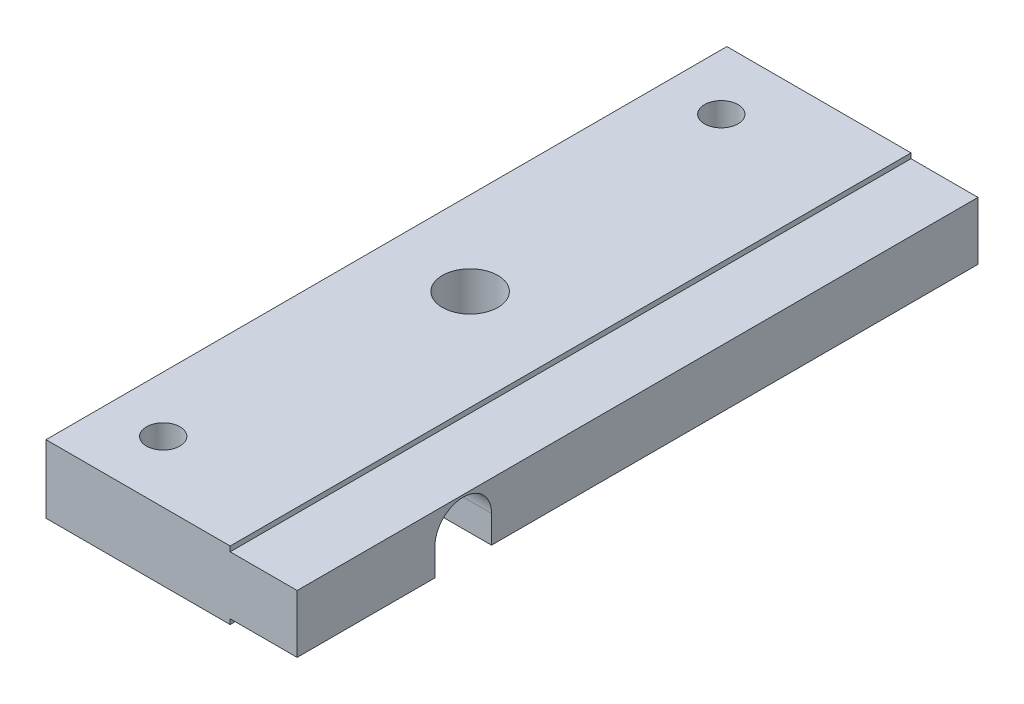
ISO-10303-21;
HEADER;
FILE_DESCRIPTION(('STEP AP214'),'2;1');
FILE_NAME('part.step','',(''),(''),'','','');
FILE_SCHEMA(('AUTOMOTIVE_DESIGN { 1 0 10303 214 1 1 1 1 }'));
ENDSEC;
DATA;
#1=APPLICATION_CONTEXT('core data for automotive mechanical design processes');
#2=APPLICATION_PROTOCOL_DEFINITION('international standard','automotive_design',2000,#1);
#3=PRODUCT_CONTEXT('',#1,'mechanical');
#4=PRODUCT('Part','Part','',(#3));
#5=PRODUCT_RELATED_PRODUCT_CATEGORY('part','',(#4));
#6=PRODUCT_DEFINITION_FORMATION('','',#4);
#7=PRODUCT_DEFINITION_CONTEXT('part definition',#1,'design');
#8=PRODUCT_DEFINITION('design','',#6,#7);
#9=PRODUCT_DEFINITION_SHAPE('','',#8);
#10=(LENGTH_UNIT() NAMED_UNIT(*) SI_UNIT(.MILLI.,.METRE.));
#11=(NAMED_UNIT(*) PLANE_ANGLE_UNIT() SI_UNIT($,.RADIAN.));
#12=(NAMED_UNIT(*) SI_UNIT($,.STERADIAN.) SOLID_ANGLE_UNIT());
#13=UNCERTAINTY_MEASURE_WITH_UNIT(LENGTH_MEASURE(1.E-05),#10,'distance_accuracy_value','');
#14=(GEOMETRIC_REPRESENTATION_CONTEXT(3) GLOBAL_UNCERTAINTY_ASSIGNED_CONTEXT((#13)) GLOBAL_UNIT_ASSIGNED_CONTEXT((#10,
#11,#12)) REPRESENTATION_CONTEXT('',''));
#15=CARTESIAN_POINT('',(0.,0.,0.));
#16=DIRECTION('',(0.,0.,1.));
#17=DIRECTION('',(1.,0.,0.));
#18=AXIS2_PLACEMENT_3D('',#15,#16,#17);
#19=CARTESIAN_POINT('',(22.5,-3.05,0.));
#20=DIRECTION('',(0.,1.,0.));
#21=DIRECTION('',(0.,0.,1.));
#22=AXIS2_PLACEMENT_3D('',#19,#20,#21);
#23=PLANE('',#22);
#24=CARTESIAN_POINT('',(5.00000000000001,-3.05,-5.5));
#25=DIRECTION('',(0.,1.,0.));
#26=DIRECTION('',(0.,0.,1.));
#27=AXIS2_PLACEMENT_3D('',#24,#25,#26);
#28=CIRCLE('',#27,1.5);
#29=CARTESIAN_POINT('',(5.00000000000001,-3.05,-4.));
#30=VERTEX_POINT('',#29);
#31=EDGE_CURVE('E302',#30,#30,#28,.T.);
#32=ORIENTED_EDGE('',*,*,#31,.T.);
#33=EDGE_LOOP('',(#32));
#34=FACE_BOUND('',#33,.T.);
#35=DIRECTION('',(0.,0.,-1.));
#36=VECTOR('',#35,1.);
#37=CARTESIAN_POINT('',(0.,-3.05,0.));
#38=LINE('',#37,#36);
#39=CARTESIAN_POINT('',(0.,-3.05,0.));
#40=VERTEX_POINT('',#39);
#41=CARTESIAN_POINT('',(0.,-3.05,-12.3486));
#42=VERTEX_POINT('',#41);
#43=EDGE_CURVE('E220',#40,#42,#38,.T.);
#44=ORIENTED_EDGE('',*,*,#43,.T.);
#45=DIRECTION('',(-1.,0.,0.));
#46=VECTOR('',#45,1.);
#47=CARTESIAN_POINT('',(22.5,-3.05,-12.3486));
#48=LINE('',#47,#46);
#49=CARTESIAN_POINT('',(16.5,-3.05,-12.3486));
#50=VERTEX_POINT('',#49);
#51=EDGE_CURVE('E171',#50,#42,#48,.T.);
#52=ORIENTED_EDGE('',*,*,#51,.F.);
#53=DIRECTION('',(0.,0.,-1.));
#54=VECTOR('',#53,1.);
#55=CARTESIAN_POINT('',(16.5,-3.05,0.));
#56=LINE('',#55,#54);
#57=CARTESIAN_POINT('',(16.5,-3.05,0.));
#58=VERTEX_POINT('',#57);
#59=EDGE_CURVE('E205',#58,#50,#56,.T.);
#60=ORIENTED_EDGE('',*,*,#59,.F.);
#61=DIRECTION('',(-1.,0.,0.));
#62=VECTOR('',#61,1.);
#63=CARTESIAN_POINT('',(22.5,-3.05,0.));
#64=LINE('',#63,#62);
#65=EDGE_CURVE('E234',#58,#40,#64,.T.);
#66=ORIENTED_EDGE('',*,*,#65,.T.);
#67=EDGE_LOOP('',(#44,#52,#60,#66));
#68=FACE_BOUND('',#67,.T.);
#69=ADVANCED_FACE('F36',(#34,#68),#23,.F.);
#70=CARTESIAN_POINT('',(16.5,-2.5976,0.));
#71=DIRECTION('',(0.,-1.,0.));
#72=DIRECTION('',(0.,0.,-1.));
#73=AXIS2_PLACEMENT_3D('',#70,#71,#72);
#74=PLANE('',#73);
#75=DIRECTION('',(-1.,0.,0.));
#76=VECTOR('',#75,1.);
#77=CARTESIAN_POINT('',(16.5,-2.5976,-12.3486));
#78=LINE('',#77,#76);
#79=CARTESIAN_POINT('',(22.5,-2.5976,-12.3486));
#80=VERTEX_POINT('',#79);
#81=CARTESIAN_POINT('',(16.5,-2.5976,-12.3486));
#82=VERTEX_POINT('',#81);
#83=EDGE_CURVE('E175',#80,#82,#78,.T.);
#84=ORIENTED_EDGE('',*,*,#83,.F.);
#85=DIRECTION('',(0.,0.,-1.));
#86=VECTOR('',#85,1.);
#87=CARTESIAN_POINT('',(22.5,-2.5976,0.));
#88=LINE('',#87,#86);
#89=CARTESIAN_POINT('',(22.5,-2.5976,0.));
#90=VERTEX_POINT('',#89);
#91=EDGE_CURVE('E185',#90,#80,#88,.T.);
#92=ORIENTED_EDGE('',*,*,#91,.F.);
#93=DIRECTION('',(1.,0.,0.));
#94=VECTOR('',#93,1.);
#95=CARTESIAN_POINT('',(16.5,-2.5976,0.));
#96=LINE('',#95,#94);
#97=CARTESIAN_POINT('',(16.5,-2.5976,0.));
#98=VERTEX_POINT('',#97);
#99=EDGE_CURVE('E184',#98,#90,#96,.T.);
#100=ORIENTED_EDGE('',*,*,#99,.F.);
#101=DIRECTION('',(0.,0.,-1.));
#102=VECTOR('',#101,1.);
#103=CARTESIAN_POINT('',(16.5,-2.5976,0.));
#104=LINE('',#103,#102);
#105=EDGE_CURVE('E177',#98,#82,#104,.T.);
#106=ORIENTED_EDGE('',*,*,#105,.T.);
#107=EDGE_LOOP('',(#84,#92,#100,#106));
#108=FACE_BOUND('',#107,.T.);
#109=ADVANCED_FACE('F261',(#108),#74,.T.);
#110=CARTESIAN_POINT('',(16.5,0.,-30.5));
#111=DIRECTION('',(1.,0.,0.));
#112=DIRECTION('',(0.,0.,-1.));
#113=AXIS2_PLACEMENT_3D('',#110,#111,#112);
#114=PLANE('',#113);
#115=DIRECTION('',(0.,-1.,0.));
#116=VECTOR('',#115,1.);
#117=CARTESIAN_POINT('',(16.5,0.,-12.3486));
#118=LINE('',#117,#116);
#119=EDGE_CURVE('E12',#82,#50,#118,.T.);
#120=ORIENTED_EDGE('',*,*,#119,.F.);
#121=ORIENTED_EDGE('',*,*,#105,.F.);
#122=DIRECTION('',(0.,-1.,0.));
#123=VECTOR('',#122,1.);
#124=CARTESIAN_POINT('',(16.5,-3.05,0.));
#125=LINE('',#124,#123);
#126=EDGE_CURVE('E204',#98,#58,#125,.T.);
#127=ORIENTED_EDGE('',*,*,#126,.T.);
#128=ORIENTED_EDGE('',*,*,#59,.T.);
#129=EDGE_LOOP('',(#120,#121,#127,#128));
#130=FACE_BOUND('',#129,.T.);
#131=ADVANCED_FACE('F264',(#130),#114,.T.);
#132=CARTESIAN_POINT('',(22.5,-3.05,0.));
#133=DIRECTION('',(0.,0.,-1.));
#134=DIRECTION('',(-1.,0.,0.));
#135=AXIS2_PLACEMENT_3D('',#132,#133,#134);
#136=PLANE('',#135);
#137=DIRECTION('',(1.,0.,0.));
#138=VECTOR('',#137,1.);
#139=CARTESIAN_POINT('',(16.5,2.5976,0.));
#140=LINE('',#139,#138);
#141=CARTESIAN_POINT('',(16.5,2.5976,0.));
#142=VERTEX_POINT('',#141);
#143=CARTESIAN_POINT('',(22.5,2.5976,0.));
#144=VERTEX_POINT('',#143);
#145=EDGE_CURVE('E190',#142,#144,#140,.T.);
#146=ORIENTED_EDGE('',*,*,#145,.F.);
#147=CARTESIAN_POINT('',(16.5,3.05,0.));
#148=VERTEX_POINT('',#147);
#149=EDGE_CURVE('E201',#148,#142,#125,.T.);
#150=ORIENTED_EDGE('',*,*,#149,.F.);
#151=DIRECTION('',(-1.,0.,0.));
#152=VECTOR('',#151,1.);
#153=CARTESIAN_POINT('',(22.5,3.05,0.));
#154=LINE('',#153,#152);
#155=CARTESIAN_POINT('',(0.,3.05,0.));
#156=VERTEX_POINT('',#155);
#157=EDGE_CURVE('E215',#148,#156,#154,.T.);
#158=ORIENTED_EDGE('',*,*,#157,.T.);
#159=DIRECTION('',(0.,-1.,0.));
#160=VECTOR('',#159,1.);
#161=CARTESIAN_POINT('',(0.,-3.05,0.));
#162=LINE('',#161,#160);
#163=EDGE_CURVE('E216',#156,#40,#162,.T.);
#164=ORIENTED_EDGE('',*,*,#163,.T.);
#165=ORIENTED_EDGE('',*,*,#65,.F.);
#166=ORIENTED_EDGE('',*,*,#126,.F.);
#167=ORIENTED_EDGE('',*,*,#99,.T.);
#168=DIRECTION('',(0.,-1.,0.));
#169=VECTOR('',#168,1.);
#170=CARTESIAN_POINT('',(22.5,-3.05,0.));
#171=LINE('',#170,#169);
#172=EDGE_CURVE('E209',#144,#90,#171,.T.);
#173=ORIENTED_EDGE('',*,*,#172,.F.);
#174=EDGE_LOOP('',(#146,#150,#158,#164,#165,#166,#167,#173));
#175=FACE_BOUND('',#174,.T.);
#176=ADVANCED_FACE('F38',(#175),#136,.F.);
#177=CARTESIAN_POINT('',(5.,-3.05,-55.5));
#178=DIRECTION('',(0.,1.,0.));
#179=DIRECTION('',(0.,0.,1.));
#180=AXIS2_PLACEMENT_3D('',#177,#178,#179);
#181=CIRCLE('',#180,1.5);
#182=CARTESIAN_POINT('',(5.,-3.05,-54.));
#183=VERTEX_POINT('',#182);
#184=EDGE_CURVE('E308',#183,#183,#181,.T.);
#185=ORIENTED_EDGE('',*,*,#184,.T.);
#186=EDGE_LOOP('',(#185));
#187=FACE_BOUND('',#186,.T.);
#188=CARTESIAN_POINT('',(7.5,-3.05,-30.5));
#189=DIRECTION('',(0.,1.,0.));
#190=DIRECTION('',(0.,0.,1.));
#191=AXIS2_PLACEMENT_3D('',#188,#189,#190);
#192=CIRCLE('',#191,2.4892);
#193=CARTESIAN_POINT('',(7.5,-3.05,-28.0108));
#194=VERTEX_POINT('',#193);
#195=EDGE_CURVE('E167',#194,#194,#192,.T.);
#196=ORIENTED_EDGE('',*,*,#195,.T.);
#197=EDGE_LOOP('',(#196));
#198=FACE_BOUND('',#197,.T.);
#199=CARTESIAN_POINT('',(16.5,-3.05,-17.4134));
#200=VERTEX_POINT('',#199);
#201=CARTESIAN_POINT('',(16.5,-3.05,-61.));
#202=VERTEX_POINT('',#201);
#203=EDGE_CURVE('E208',#200,#202,#56,.T.);
#204=ORIENTED_EDGE('',*,*,#203,.F.);
#205=DIRECTION('',(-1.,0.,0.));
#206=VECTOR('',#205,1.);
#207=CARTESIAN_POINT('',(22.5,-3.05,-17.4134));
#208=LINE('',#207,#206);
#209=CARTESIAN_POINT('',(0.,-3.05,-17.4134));
#210=VERTEX_POINT('',#209);
#211=EDGE_CURVE('E51',#200,#210,#208,.T.);
#212=ORIENTED_EDGE('',*,*,#211,.T.);
#213=CARTESIAN_POINT('',(0.,-3.05,-61.));
#214=VERTEX_POINT('',#213);
#215=EDGE_CURVE('E219',#210,#214,#38,.T.);
#216=ORIENTED_EDGE('',*,*,#215,.T.);
#217=DIRECTION('',(-1.,0.,0.));
#218=VECTOR('',#217,1.);
#219=CARTESIAN_POINT('',(22.5,-3.05,-61.));
#220=LINE('',#219,#218);
#221=EDGE_CURVE('E231',#202,#214,#220,.T.);
#222=ORIENTED_EDGE('',*,*,#221,.F.);
#223=EDGE_LOOP('',(#204,#212,#216,#222));
#224=FACE_BOUND('',#223,.T.);
#225=ADVANCED_FACE('F284',(#187,#198,#224),#23,.F.);
#226=CARTESIAN_POINT('',(22.5,-3.05,-61.));
#227=DIRECTION('',(0.,0.,1.));
#228=DIRECTION('',(1.,0.,0.));
#229=AXIS2_PLACEMENT_3D('',#226,#227,#228);
#230=PLANE('',#229);
#231=DIRECTION('',(1.,0.,0.));
#232=VECTOR('',#231,1.);
#233=CARTESIAN_POINT('',(16.5,2.5976,-61.));
#234=LINE('',#233,#232);
#235=CARTESIAN_POINT('',(16.5,2.5976,-61.));
#236=VERTEX_POINT('',#235);
#237=CARTESIAN_POINT('',(22.5,2.5976,-61.));
#238=VERTEX_POINT('',#237);
#239=EDGE_CURVE('E193',#236,#238,#234,.T.);
#240=ORIENTED_EDGE('',*,*,#239,.T.);
#241=DIRECTION('',(0.,1.,0.));
#242=VECTOR('',#241,1.);
#243=CARTESIAN_POINT('',(22.5,-3.05,-61.));
#244=LINE('',#243,#242);
#245=CARTESIAN_POINT('',(22.5,-2.5976,-61.));
#246=VERTEX_POINT('',#245);
#247=EDGE_CURVE('E212',#246,#238,#244,.T.);
#248=ORIENTED_EDGE('',*,*,#247,.F.);
#249=DIRECTION('',(1.,0.,0.));
#250=VECTOR('',#249,1.);
#251=CARTESIAN_POINT('',(16.5,-2.5976,-61.));
#252=LINE('',#251,#250);
#253=CARTESIAN_POINT('',(16.5,-2.5976,-61.));
#254=VERTEX_POINT('',#253);
#255=EDGE_CURVE('E196',#254,#246,#252,.T.);
#256=ORIENTED_EDGE('',*,*,#255,.F.);
#257=DIRECTION('',(0.,1.,0.));
#258=VECTOR('',#257,1.);
#259=CARTESIAN_POINT('',(16.5,-3.05,-61.));
#260=LINE('',#259,#258);
#261=EDGE_CURVE('E202',#202,#254,#260,.T.);
#262=ORIENTED_EDGE('',*,*,#261,.F.);
#263=ORIENTED_EDGE('',*,*,#221,.T.);
#264=DIRECTION('',(0.,1.,0.));
#265=VECTOR('',#264,1.);
#266=CARTESIAN_POINT('',(0.,-3.05,-61.));
#267=LINE('',#266,#265);
#268=CARTESIAN_POINT('',(0.,3.05,-61.));
#269=VERTEX_POINT('',#268);
#270=EDGE_CURVE('E223',#214,#269,#267,.T.);
#271=ORIENTED_EDGE('',*,*,#270,.T.);
#272=DIRECTION('',(-1.,0.,0.));
#273=VECTOR('',#272,1.);
#274=CARTESIAN_POINT('',(22.5,3.05,-61.));
#275=LINE('',#274,#273);
#276=CARTESIAN_POINT('',(16.5,3.05,-61.));
#277=VERTEX_POINT('',#276);
#278=EDGE_CURVE('E229',#277,#269,#275,.T.);
#279=ORIENTED_EDGE('',*,*,#278,.F.);
#280=EDGE_CURVE('E192',#236,#277,#260,.T.);
#281=ORIENTED_EDGE('',*,*,#280,.F.);
#282=EDGE_LOOP('',(#240,#248,#256,#262,#263,#271,#279,#281));
#283=FACE_BOUND('',#282,.T.);
#284=ADVANCED_FACE('F249',(#283),#230,.F.);
#285=CARTESIAN_POINT('',(22.5,3.05,0.));
#286=DIRECTION('',(0.,-1.,0.));
#287=DIRECTION('',(0.,0.,-1.));
#288=AXIS2_PLACEMENT_3D('',#285,#286,#287);
#289=PLANE('',#288);
#290=CARTESIAN_POINT('',(5.00000000000001,3.05,-5.5));
#291=DIRECTION('',(0.,1.,0.));
#292=DIRECTION('',(0.,0.,1.));
#293=AXIS2_PLACEMENT_3D('',#290,#291,#292);
#294=CIRCLE('',#293,1.5);
#295=CARTESIAN_POINT('',(5.00000000000001,3.05,-4.));
#296=VERTEX_POINT('',#295);
#297=EDGE_CURVE('E305',#296,#296,#294,.T.);
#298=ORIENTED_EDGE('',*,*,#297,.F.);
#299=EDGE_LOOP('',(#298));
#300=FACE_BOUND('',#299,.T.);
#301=CARTESIAN_POINT('',(5.,3.05,-55.5));
#302=DIRECTION('',(0.,1.,0.));
#303=DIRECTION('',(0.,0.,1.));
#304=AXIS2_PLACEMENT_3D('',#301,#302,#303);
#305=CIRCLE('',#304,1.5);
#306=CARTESIAN_POINT('',(5.,3.05,-54.));
#307=VERTEX_POINT('',#306);
#308=EDGE_CURVE('E304',#307,#307,#305,.T.);
#309=ORIENTED_EDGE('',*,*,#308,.F.);
#310=EDGE_LOOP('',(#309));
#311=FACE_BOUND('',#310,.T.);
#312=CARTESIAN_POINT('',(7.5,3.05,-30.5));
#313=DIRECTION('',(0.,1.,0.));
#314=DIRECTION('',(0.,0.,1.));
#315=AXIS2_PLACEMENT_3D('',#312,#313,#314);
#316=CIRCLE('',#315,2.4892);
#317=CARTESIAN_POINT('',(7.5,3.05,-28.0108));
#318=VERTEX_POINT('',#317);
#319=EDGE_CURVE('E162',#318,#318,#316,.T.);
#320=ORIENTED_EDGE('',*,*,#319,.F.);
#321=EDGE_LOOP('',(#320));
#322=FACE_BOUND('',#321,.T.);
#323=DIRECTION('',(0.,0.,1.));
#324=VECTOR('',#323,1.);
#325=CARTESIAN_POINT('',(16.5,3.05,0.));
#326=LINE('',#325,#324);
#327=EDGE_CURVE('E236',#277,#148,#326,.T.);
#328=ORIENTED_EDGE('',*,*,#327,.F.);
#329=ORIENTED_EDGE('',*,*,#278,.T.);
#330=DIRECTION('',(0.,0.,1.));
#331=VECTOR('',#330,1.);
#332=CARTESIAN_POINT('',(0.,3.05,0.));
#333=LINE('',#332,#331);
#334=EDGE_CURVE('E213',#269,#156,#333,.T.);
#335=ORIENTED_EDGE('',*,*,#334,.T.);
#336=ORIENTED_EDGE('',*,*,#157,.F.);
#337=EDGE_LOOP('',(#328,#329,#335,#336));
#338=FACE_BOUND('',#337,.T.);
#339=ADVANCED_FACE('F279',(#300,#311,#322,#338),#289,.F.);
#340=CARTESIAN_POINT('',(22.5,3.05,0.));
#341=DIRECTION('',(-1.,0.,0.));
#342=DIRECTION('',(0.,0.,1.));
#343=AXIS2_PLACEMENT_3D('',#340,#341,#342);
#344=PLANE('',#343);
#345=ORIENTED_EDGE('',*,*,#91,.T.);
#346=DIRECTION('',(0.,1.,0.));
#347=VECTOR('',#346,1.);
#348=CARTESIAN_POINT('',(22.5,-0.127799999999999,-12.3486));
#349=LINE('',#348,#347);
#350=CARTESIAN_POINT('',(22.5,-0.127799999999999,-12.3486));
#351=VERTEX_POINT('',#350);
#352=EDGE_CURVE('E147',#80,#351,#349,.T.);
#353=ORIENTED_EDGE('',*,*,#352,.T.);
#354=CARTESIAN_POINT('',(22.5,-0.1278,-14.881));
#355=DIRECTION('',(-1.,0.,0.));
#356=DIRECTION('',(0.,0.,1.));
#357=AXIS2_PLACEMENT_3D('',#354,#355,#356);
#358=CIRCLE('',#357,2.5324);
#359=CARTESIAN_POINT('',(22.5,-0.1278,-17.4134));
#360=VERTEX_POINT('',#359);
#361=EDGE_CURVE('E142',#351,#360,#358,.T.);
#362=ORIENTED_EDGE('',*,*,#361,.T.);
#363=DIRECTION('',(0.,-1.,0.));
#364=VECTOR('',#363,1.);
#365=CARTESIAN_POINT('',(22.5,-3.05,-17.4134));
#366=LINE('',#365,#364);
#367=CARTESIAN_POINT('',(22.5,-2.5976,-17.4134));
#368=VERTEX_POINT('',#367);
#369=EDGE_CURVE('E149',#360,#368,#366,.T.);
#370=ORIENTED_EDGE('',*,*,#369,.T.);
#371=EDGE_CURVE('E59',#368,#246,#88,.T.);
#372=ORIENTED_EDGE('',*,*,#371,.T.);
#373=ORIENTED_EDGE('',*,*,#247,.T.);
#374=DIRECTION('',(0.,0.,1.));
#375=VECTOR('',#374,1.);
#376=CARTESIAN_POINT('',(22.5,2.5976,0.));
#377=LINE('',#376,#375);
#378=EDGE_CURVE('E187',#238,#144,#377,.T.);
#379=ORIENTED_EDGE('',*,*,#378,.T.);
#380=ORIENTED_EDGE('',*,*,#172,.T.);
#381=EDGE_LOOP('',(#345,#353,#362,#370,#372,#373,#379,#380));
#382=FACE_BOUND('',#381,.T.);
#383=ADVANCED_FACE('F155',(#382),#344,.F.);
#384=CARTESIAN_POINT('',(0.,3.05,0.));
#385=DIRECTION('',(-1.,0.,0.));
#386=DIRECTION('',(0.,0.,1.));
#387=AXIS2_PLACEMENT_3D('',#384,#385,#386);
#388=PLANE('',#387);
#389=DIRECTION('',(0.,1.,0.));
#390=VECTOR('',#389,1.);
#391=CARTESIAN_POINT('',(0.,-0.127799999999999,-12.3486));
#392=LINE('',#391,#390);
#393=CARTESIAN_POINT('',(0.,-0.127799999999999,-12.3486));
#394=VERTEX_POINT('',#393);
#395=EDGE_CURVE('E156',#42,#394,#392,.T.);
#396=ORIENTED_EDGE('',*,*,#395,.F.);
#397=ORIENTED_EDGE('',*,*,#43,.F.);
#398=ORIENTED_EDGE('',*,*,#163,.F.);
#399=ORIENTED_EDGE('',*,*,#334,.F.);
#400=ORIENTED_EDGE('',*,*,#270,.F.);
#401=ORIENTED_EDGE('',*,*,#215,.F.);
#402=DIRECTION('',(0.,-1.,0.));
#403=VECTOR('',#402,1.);
#404=CARTESIAN_POINT('',(0.,-3.05,-17.4134));
#405=LINE('',#404,#403);
#406=CARTESIAN_POINT('',(0.,-0.1278,-17.4134));
#407=VERTEX_POINT('',#406);
#408=EDGE_CURVE('E159',#407,#210,#405,.T.);
#409=ORIENTED_EDGE('',*,*,#408,.F.);
#410=CARTESIAN_POINT('',(0.,-0.1278,-14.881));
#411=DIRECTION('',(-1.,0.,0.));
#412=DIRECTION('',(0.,0.,1.));
#413=AXIS2_PLACEMENT_3D('',#410,#411,#412);
#414=CIRCLE('',#413,2.5324);
#415=EDGE_CURVE('E145',#394,#407,#414,.T.);
#416=ORIENTED_EDGE('',*,*,#415,.F.);
#417=EDGE_LOOP('',(#396,#397,#398,#399,#400,#401,#409,#416));
#418=FACE_BOUND('',#417,.T.);
#419=ADVANCED_FACE('F274',(#418),#388,.T.);
#420=DIRECTION('',(1.,0.,0.));
#421=VECTOR('',#420,1.);
#422=CARTESIAN_POINT('',(16.5,-2.5976,-17.4134));
#423=LINE('',#422,#421);
#424=CARTESIAN_POINT('',(16.5,-2.5976,-17.4134));
#425=VERTEX_POINT('',#424);
#426=EDGE_CURVE('E152',#425,#368,#423,.T.);
#427=ORIENTED_EDGE('',*,*,#426,.F.);
#428=EDGE_CURVE('E181',#425,#254,#104,.T.);
#429=ORIENTED_EDGE('',*,*,#428,.T.);
#430=ORIENTED_EDGE('',*,*,#255,.T.);
#431=ORIENTED_EDGE('',*,*,#371,.F.);
#432=EDGE_LOOP('',(#427,#429,#430,#431));
#433=FACE_BOUND('',#432,.T.);
#434=ADVANCED_FACE('F241',(#433),#74,.T.);
#435=DIRECTION('',(0.,1.,0.));
#436=VECTOR('',#435,1.);
#437=CARTESIAN_POINT('',(16.5,0.,-17.4134));
#438=LINE('',#437,#436);
#439=EDGE_CURVE('E44',#200,#425,#438,.T.);
#440=ORIENTED_EDGE('',*,*,#439,.F.);
#441=ORIENTED_EDGE('',*,*,#203,.T.);
#442=ORIENTED_EDGE('',*,*,#261,.T.);
#443=ORIENTED_EDGE('',*,*,#428,.F.);
#444=EDGE_LOOP('',(#440,#441,#442,#443));
#445=FACE_BOUND('',#444,.T.);
#446=ADVANCED_FACE('F243',(#445),#114,.T.);
#447=ORIENTED_EDGE('',*,*,#149,.T.);
#448=DIRECTION('',(0.,0.,1.));
#449=VECTOR('',#448,1.);
#450=CARTESIAN_POINT('',(16.5,2.5976,0.));
#451=LINE('',#450,#449);
#452=EDGE_CURVE('E180',#236,#142,#451,.T.);
#453=ORIENTED_EDGE('',*,*,#452,.F.);
#454=ORIENTED_EDGE('',*,*,#280,.T.);
#455=ORIENTED_EDGE('',*,*,#327,.T.);
#456=EDGE_LOOP('',(#447,#453,#454,#455));
#457=FACE_BOUND('',#456,.T.);
#458=ADVANCED_FACE('F333',(#457),#114,.T.);
#459=CARTESIAN_POINT('',(16.5,2.5976,0.));
#460=DIRECTION('',(0.,1.,0.));
#461=DIRECTION('',(0.,0.,1.));
#462=AXIS2_PLACEMENT_3D('',#459,#460,#461);
#463=PLANE('',#462);
#464=ORIENTED_EDGE('',*,*,#378,.F.);
#465=ORIENTED_EDGE('',*,*,#239,.F.);
#466=ORIENTED_EDGE('',*,*,#452,.T.);
#467=ORIENTED_EDGE('',*,*,#145,.T.);
#468=EDGE_LOOP('',(#464,#465,#466,#467));
#469=FACE_BOUND('',#468,.T.);
#470=ADVANCED_FACE('F336',(#469),#463,.T.);
#471=CARTESIAN_POINT('',(22.5,-0.1278,-14.881));
#472=DIRECTION('',(-1.,0.,0.));
#473=DIRECTION('',(0.,0.,1.));
#474=AXIS2_PLACEMENT_3D('',#471,#472,#473);
#475=CYLINDRICAL_SURFACE('',#474,2.5324);
#476=ORIENTED_EDGE('',*,*,#415,.T.);
#477=DIRECTION('',(-1.,0.,0.));
#478=VECTOR('',#477,1.);
#479=CARTESIAN_POINT('',(22.5,-0.1278,-17.4134));
#480=LINE('',#479,#478);
#481=EDGE_CURVE('E138',#360,#407,#480,.T.);
#482=ORIENTED_EDGE('',*,*,#481,.F.);
#483=ORIENTED_EDGE('',*,*,#361,.F.);
#484=DIRECTION('',(-1.,0.,0.));
#485=VECTOR('',#484,1.);
#486=CARTESIAN_POINT('',(22.5,-0.127799999999999,-12.3486));
#487=LINE('',#486,#485);
#488=EDGE_CURVE('E169',#351,#394,#487,.T.);
#489=ORIENTED_EDGE('',*,*,#488,.T.);
#490=EDGE_LOOP('',(#476,#482,#483,#489));
#491=FACE_BOUND('',#490,.T.);
#492=ADVANCED_FACE('F140',(#491),#475,.F.);
#493=CARTESIAN_POINT('',(22.5,-0.127799999999999,-12.3486));
#494=DIRECTION('',(0.,0.,1.));
#495=DIRECTION('',(1.,0.,0.));
#496=AXIS2_PLACEMENT_3D('',#493,#494,#495);
#497=PLANE('',#496);
#498=ORIENTED_EDGE('',*,*,#83,.T.);
#499=ORIENTED_EDGE('',*,*,#119,.T.);
#500=ORIENTED_EDGE('',*,*,#51,.T.);
#501=ORIENTED_EDGE('',*,*,#395,.T.);
#502=ORIENTED_EDGE('',*,*,#488,.F.);
#503=ORIENTED_EDGE('',*,*,#352,.F.);
#504=EDGE_LOOP('',(#498,#499,#500,#501,#502,#503));
#505=FACE_BOUND('',#504,.T.);
#506=ADVANCED_FACE('F268',(#505),#497,.F.);
#507=CARTESIAN_POINT('',(22.5,-3.05,-17.4134));
#508=DIRECTION('',(0.,0.,-1.));
#509=DIRECTION('',(-1.,0.,0.));
#510=AXIS2_PLACEMENT_3D('',#507,#508,#509);
#511=PLANE('',#510);
#512=ORIENTED_EDGE('',*,*,#426,.T.);
#513=ORIENTED_EDGE('',*,*,#369,.F.);
#514=ORIENTED_EDGE('',*,*,#481,.T.);
#515=ORIENTED_EDGE('',*,*,#408,.T.);
#516=ORIENTED_EDGE('',*,*,#211,.F.);
#517=ORIENTED_EDGE('',*,*,#439,.T.);
#518=EDGE_LOOP('',(#512,#513,#514,#515,#516,#517));
#519=FACE_BOUND('',#518,.T.);
#520=ADVANCED_FACE('F150',(#519),#511,.F.);
#521=CARTESIAN_POINT('',(7.5,-3.05,-30.5));
#522=DIRECTION('',(0.,1.,0.));
#523=DIRECTION('',(0.,0.,1.));
#524=AXIS2_PLACEMENT_3D('',#521,#522,#523);
#525=CYLINDRICAL_SURFACE('',#524,2.4892);
#526=ORIENTED_EDGE('',*,*,#195,.F.);
#527=EDGE_LOOP('',(#526));
#528=FACE_BOUND('',#527,.T.);
#529=ORIENTED_EDGE('',*,*,#319,.T.);
#530=EDGE_LOOP('',(#529));
#531=FACE_BOUND('',#530,.T.);
#532=ADVANCED_FACE('F318',(#528,#531),#525,.F.);
#533=CARTESIAN_POINT('',(5.,-3.05,-55.5));
#534=DIRECTION('',(0.,1.,0.));
#535=DIRECTION('',(0.,0.,1.));
#536=AXIS2_PLACEMENT_3D('',#533,#534,#535);
#537=CYLINDRICAL_SURFACE('',#536,1.5);
#538=ORIENTED_EDGE('',*,*,#184,.F.);
#539=EDGE_LOOP('',(#538));
#540=FACE_BOUND('',#539,.T.);
#541=ORIENTED_EDGE('',*,*,#308,.T.);
#542=EDGE_LOOP('',(#541));
#543=FACE_BOUND('',#542,.T.);
#544=ADVANCED_FACE('F347',(#540,#543),#537,.F.);
#545=CARTESIAN_POINT('',(5.00000000000001,-3.05,-5.5));
#546=DIRECTION('',(0.,1.,0.));
#547=DIRECTION('',(0.,0.,1.));
#548=AXIS2_PLACEMENT_3D('',#545,#546,#547);
#549=CYLINDRICAL_SURFACE('',#548,1.5);
#550=ORIENTED_EDGE('',*,*,#31,.F.);
#551=EDGE_LOOP('',(#550));
#552=FACE_BOUND('',#551,.T.);
#553=ORIENTED_EDGE('',*,*,#297,.T.);
#554=EDGE_LOOP('',(#553));
#555=FACE_BOUND('',#554,.T.);
#556=ADVANCED_FACE('F351',(#552,#555),#549,.F.);
#557=CLOSED_SHELL('',(#69,#109,#131,#176,#225,#284,#339,#383,#419,#434,#446,#458,#470,#492,#506,
#520,#532,#544,#556));
#558=MANIFOLD_SOLID_BREP('B2',#557);
#559=ADVANCED_BREP_SHAPE_REPRESENTATION('',(#18,#558),#14);
#560=SHAPE_DEFINITION_REPRESENTATION(#9,#559);
ENDSEC;
END-ISO-10303-21;
